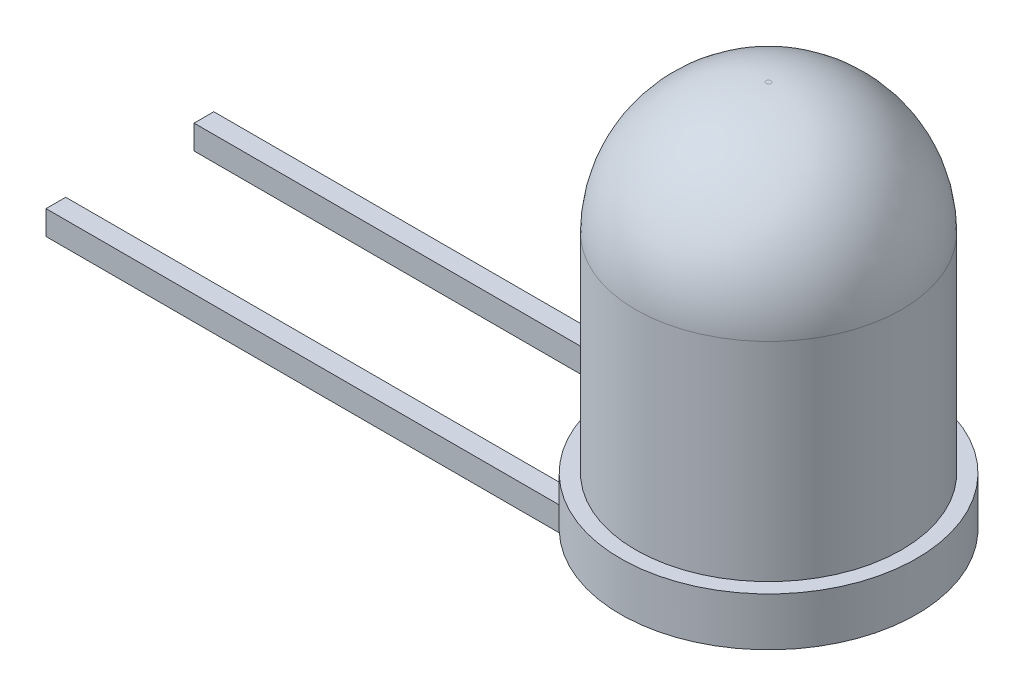
ISO-10303-21;
HEADER;
FILE_DESCRIPTION(('STEP AP214'),'2;1');
FILE_NAME('part.step','',(''),(''),'','','');
FILE_SCHEMA(('AUTOMOTIVE_DESIGN { 1 0 10303 214 1 1 1 1 }'));
ENDSEC;
DATA;
#1=APPLICATION_CONTEXT('core data for automotive mechanical design processes');
#2=APPLICATION_PROTOCOL_DEFINITION('international standard','automotive_design',2000,#1);
#3=PRODUCT_CONTEXT('',#1,'mechanical');
#4=PRODUCT('Part','Part','',(#3));
#5=PRODUCT_RELATED_PRODUCT_CATEGORY('part','',(#4));
#6=PRODUCT_DEFINITION_FORMATION('','',#4);
#7=PRODUCT_DEFINITION_CONTEXT('part definition',#1,'design');
#8=PRODUCT_DEFINITION('design','',#6,#7);
#9=PRODUCT_DEFINITION_SHAPE('','',#8);
#10=(LENGTH_UNIT() NAMED_UNIT(*) SI_UNIT(.MILLI.,.METRE.));
#11=(NAMED_UNIT(*) PLANE_ANGLE_UNIT() SI_UNIT($,.RADIAN.));
#12=(NAMED_UNIT(*) SI_UNIT($,.STERADIAN.) SOLID_ANGLE_UNIT());
#13=UNCERTAINTY_MEASURE_WITH_UNIT(LENGTH_MEASURE(1.E-05),#10,'distance_accuracy_value','');
#14=(GEOMETRIC_REPRESENTATION_CONTEXT(3) GLOBAL_UNCERTAINTY_ASSIGNED_CONTEXT((#13)) GLOBAL_UNIT_ASSIGNED_CONTEXT((#10,
#11,#12)) REPRESENTATION_CONTEXT('',''));
#15=CARTESIAN_POINT('',(0.,0.,0.));
#16=DIRECTION('',(0.,0.,1.));
#17=DIRECTION('',(1.,0.,0.));
#18=AXIS2_PLACEMENT_3D('',#15,#16,#17);
#19=CARTESIAN_POINT('',(0.,7.,0.));
#20=DIRECTION('',(0.,-1.,0.));
#21=DIRECTION('',(0.,0.,-1.));
#22=AXIS2_PLACEMENT_3D('',#19,#20,#21);
#23=CYLINDRICAL_SURFACE('',#22,2.75);
#24=CARTESIAN_POINT('',(0.,4.3,0.));
#25=DIRECTION('',(0.,1.,0.));
#26=DIRECTION('',(0.,0.,1.));
#27=AXIS2_PLACEMENT_3D('',#24,#25,#26);
#28=CIRCLE('',#27,2.75);
#29=CARTESIAN_POINT('',(0.,4.3,2.75));
#30=VERTEX_POINT('',#29);
#31=EDGE_CURVE('E190',#30,#30,#28,.F.);
#32=ORIENTED_EDGE('',*,*,#31,.T.);
#33=EDGE_LOOP('',(#32));
#34=FACE_BOUND('',#33,.T.);
#35=CARTESIAN_POINT('',(0.,0.,0.));
#36=DIRECTION('',(0.,-1.,0.));
#37=DIRECTION('',(0.,0.,-1.));
#38=AXIS2_PLACEMENT_3D('',#35,#36,#37);
#39=CIRCLE('',#38,2.75);
#40=CARTESIAN_POINT('',(0.,0.,-2.75));
#41=VERTEX_POINT('',#40);
#42=EDGE_CURVE('E180',#41,#41,#39,.T.);
#43=ORIENTED_EDGE('',*,*,#42,.F.);
#44=EDGE_LOOP('',(#43));
#45=FACE_BOUND('',#44,.T.);
#46=ADVANCED_FACE('F37',(#34,#45),#23,.T.);
#47=CARTESIAN_POINT('',(0.,7.,0.));
#48=DIRECTION('',(0.,1.,0.));
#49=DIRECTION('',(0.,0.,1.));
#50=AXIS2_PLACEMENT_3D('',#47,#48,#49);
#51=PLANE('',#50);
#52=CARTESIAN_POINT('',(0.,7.,0.));
#53=DIRECTION('',(0.,1.,0.));
#54=DIRECTION('',(0.,0.,1.));
#55=AXIS2_PLACEMENT_3D('',#52,#53,#54);
#56=CIRCLE('',#55,0.0500000000000001);
#57=CARTESIAN_POINT('',(0.,7.,0.0500000000000001));
#58=VERTEX_POINT('',#57);
#59=EDGE_CURVE('E187',#58,#58,#56,.T.);
#60=ORIENTED_EDGE('',*,*,#59,.T.);
#61=EDGE_LOOP('',(#60));
#62=FACE_BOUND('',#61,.T.);
#63=ADVANCED_FACE('F236',(#62),#51,.T.);
#64=CARTESIAN_POINT('',(0.,4.3,0.));
#65=DIRECTION('',(0.,1.,0.));
#66=DIRECTION('',(0.,0.,1.));
#67=AXIS2_PLACEMENT_3D('',#64,#65,#66);
#68=DEGENERATE_TOROIDAL_SURFACE('',#67,0.0500000000000001,2.7,.T.);
#69=ORIENTED_EDGE('',*,*,#31,.F.);
#70=EDGE_LOOP('',(#69));
#71=FACE_BOUND('',#70,.T.);
#72=ORIENTED_EDGE('',*,*,#59,.F.);
#73=EDGE_LOOP('',(#72));
#74=FACE_BOUND('',#73,.T.);
#75=ADVANCED_FACE('F242',(#71,#74),#68,.T.);
#76=CARTESIAN_POINT('',(0.,0.,0.));
#77=DIRECTION('',(0.,-1.,0.));
#78=DIRECTION('',(0.,0.,-1.));
#79=AXIS2_PLACEMENT_3D('',#76,#77,#78);
#80=PLANE('',#79);
#81=CARTESIAN_POINT('',(0.,0.,0.));
#82=DIRECTION('',(0.,-1.,0.));
#83=DIRECTION('',(0.,0.,-1.));
#84=AXIS2_PLACEMENT_3D('',#81,#82,#83);
#85=CIRCLE('',#84,3.06128010774859);
#86=CARTESIAN_POINT('',(0.,0.,-3.06128010774859));
#87=VERTEX_POINT('',#86);
#88=EDGE_CURVE('E176',#87,#87,#85,.T.);
#89=ORIENTED_EDGE('',*,*,#88,.F.);
#90=EDGE_LOOP('',(#89));
#91=FACE_BOUND('',#90,.T.);
#92=ORIENTED_EDGE('',*,*,#42,.T.);
#93=EDGE_LOOP('',(#92));
#94=FACE_BOUND('',#93,.T.);
#95=ADVANCED_FACE('F249',(#91,#94),#80,.F.);
#96=CARTESIAN_POINT('',(0.,-1.,0.));
#97=DIRECTION('',(0.,1.,0.));
#98=DIRECTION('',(0.,0.,1.));
#99=AXIS2_PLACEMENT_3D('',#96,#97,#98);
#100=CYLINDRICAL_SURFACE('',#99,3.06128010774859);
#101=CARTESIAN_POINT('',(0.,-1.,0.));
#102=DIRECTION('',(0.,-1.,0.));
#103=DIRECTION('',(0.,0.,-1.));
#104=AXIS2_PLACEMENT_3D('',#101,#102,#103);
#105=CIRCLE('',#104,3.06128010774859);
#106=CARTESIAN_POINT('',(-2.52263573457192,-1.,1.73428511172702));
#107=VERTEX_POINT('',#106);
#108=CARTESIAN_POINT('',(-2.75871712551884,-1.,1.32699499602157));
#109=VERTEX_POINT('',#108);
#110=EDGE_CURVE('E177',#107,#109,#105,.T.);
#111=ORIENTED_EDGE('',*,*,#110,.F.);
#112=CARTESIAN_POINT('',(-2.52263573457192,-1.,-1.73428511172702));
#113=VERTEX_POINT('',#112);
#114=EDGE_CURVE('E182',#113,#107,#105,.T.);
#115=ORIENTED_EDGE('',*,*,#114,.F.);
#116=CARTESIAN_POINT('',(-2.75871712551884,-1.,-1.32699499602157));
#117=VERTEX_POINT('',#116);
#118=EDGE_CURVE('E268',#117,#113,#105,.T.);
#119=ORIENTED_EDGE('',*,*,#118,.F.);
#120=EDGE_CURVE('E181',#109,#117,#105,.T.);
#121=ORIENTED_EDGE('',*,*,#120,.F.);
#122=EDGE_LOOP('',(#111,#115,#119,#121));
#123=FACE_BOUND('',#122,.T.);
#124=ORIENTED_EDGE('',*,*,#88,.T.);
#125=EDGE_LOOP('',(#124));
#126=FACE_BOUND('',#125,.T.);
#127=ADVANCED_FACE('F270',(#123,#126),#100,.T.);
#128=CARTESIAN_POINT('',(0.,-1.,0.));
#129=DIRECTION('',(0.,-1.,0.));
#130=DIRECTION('',(0.,0.,-1.));
#131=AXIS2_PLACEMENT_3D('',#128,#129,#130);
#132=PLANE('',#131);
#133=DIRECTION('',(-1.,0.,0.));
#134=VECTOR('',#133,1.);
#135=CARTESIAN_POINT('',(0.,-1.,-1.32699499602157));
#136=LINE('',#135,#134);
#137=CARTESIAN_POINT('',(0.,-1.,-1.32699499602157));
#138=VERTEX_POINT('',#137);
#139=EDGE_CURVE('E196',#138,#117,#136,.T.);
#140=ORIENTED_EDGE('',*,*,#139,.F.);
#141=DIRECTION('',(0.,0.,1.));
#142=VECTOR('',#141,1.);
#143=CARTESIAN_POINT('',(0.,-1.,0.));
#144=LINE('',#143,#142);
#145=CARTESIAN_POINT('',(0.,-1.,-1.73428511172702));
#146=VERTEX_POINT('',#145);
#147=EDGE_CURVE('E139',#146,#138,#144,.T.);
#148=ORIENTED_EDGE('',*,*,#147,.F.);
#149=DIRECTION('',(-1.,0.,0.));
#150=VECTOR('',#149,1.);
#151=CARTESIAN_POINT('',(0.,-1.,-1.73428511172702));
#152=LINE('',#151,#150);
#153=EDGE_CURVE('E193',#146,#113,#152,.T.);
#154=ORIENTED_EDGE('',*,*,#153,.T.);
#155=ORIENTED_EDGE('',*,*,#114,.T.);
#156=DIRECTION('',(1.,0.,0.));
#157=VECTOR('',#156,1.);
#158=CARTESIAN_POINT('',(0.,-1.,1.73428511172702));
#159=LINE('',#158,#157);
#160=CARTESIAN_POINT('',(0.,-1.,1.73428511172702));
#161=VERTEX_POINT('',#160);
#162=EDGE_CURVE('E170',#107,#161,#159,.T.);
#163=ORIENTED_EDGE('',*,*,#162,.T.);
#164=DIRECTION('',(0.,0.,1.));
#165=VECTOR('',#164,1.);
#166=CARTESIAN_POINT('',(0.,-1.,0.));
#167=LINE('',#166,#165);
#168=CARTESIAN_POINT('',(0.,-1.,1.32699499602157));
#169=VERTEX_POINT('',#168);
#170=EDGE_CURVE('E164',#169,#161,#167,.T.);
#171=ORIENTED_EDGE('',*,*,#170,.F.);
#172=DIRECTION('',(1.,0.,0.));
#173=VECTOR('',#172,1.);
#174=CARTESIAN_POINT('',(0.,-1.,1.32699499602157));
#175=LINE('',#174,#173);
#176=EDGE_CURVE('E165',#109,#169,#175,.T.);
#177=ORIENTED_EDGE('',*,*,#176,.F.);
#178=ORIENTED_EDGE('',*,*,#120,.T.);
#179=EDGE_LOOP('',(#140,#148,#154,#155,#163,#171,#177,#178));
#180=FACE_BOUND('',#179,.T.);
#181=ADVANCED_FACE('F212',(#180),#132,.T.);
#182=CARTESIAN_POINT('',(0.,-1.,0.));
#183=DIRECTION('',(0.,-1.,0.));
#184=DIRECTION('',(0.,0.,-1.));
#185=AXIS2_PLACEMENT_3D('',#182,#183,#184);
#186=PLANE('',#185);
#187=CARTESIAN_POINT('',(-13.2030457028804,-1.,1.73428511172702));
#188=VERTEX_POINT('',#187);
#189=EDGE_CURVE('E167',#188,#107,#159,.T.);
#190=ORIENTED_EDGE('',*,*,#189,.T.);
#191=ORIENTED_EDGE('',*,*,#110,.T.);
#192=CARTESIAN_POINT('',(-13.2030457028804,-1.,1.32699499602157));
#193=VERTEX_POINT('',#192);
#194=EDGE_CURVE('E123',#193,#109,#175,.T.);
#195=ORIENTED_EDGE('',*,*,#194,.F.);
#196=DIRECTION('',(0.,0.,1.));
#197=VECTOR('',#196,1.);
#198=CARTESIAN_POINT('',(-13.2030457028804,-1.,0.));
#199=LINE('',#198,#197);
#200=EDGE_CURVE('E155',#193,#188,#199,.T.);
#201=ORIENTED_EDGE('',*,*,#200,.T.);
#202=EDGE_LOOP('',(#190,#191,#195,#201));
#203=FACE_BOUND('',#202,.T.);
#204=ADVANCED_FACE('F223',(#203),#186,.F.);
#205=CARTESIAN_POINT('',(0.,-1.5,1.32699499602157));
#206=DIRECTION('',(0.,0.,1.));
#207=DIRECTION('',(1.,0.,0.));
#208=AXIS2_PLACEMENT_3D('',#205,#206,#207);
#209=PLANE('',#208);
#210=ORIENTED_EDGE('',*,*,#176,.T.);
#211=CARTESIAN_POINT('',(-0.670820393249937,-0.8,1.32699499602157));
#212=DIRECTION('',(0.,0.,1.));
#213=DIRECTION('',(1.,0.,0.));
#214=AXIS2_PLACEMENT_3D('',#211,#212,#213);
#215=CIRCLE('',#214,0.7);
#216=CARTESIAN_POINT('',(-0.670820393249937,-1.5,1.32699499602157));
#217=VERTEX_POINT('',#216);
#218=EDGE_CURVE('E11',#169,#217,#215,.F.);
#219=ORIENTED_EDGE('',*,*,#218,.T.);
#220=DIRECTION('',(1.,0.,0.));
#221=VECTOR('',#220,1.);
#222=CARTESIAN_POINT('',(0.,-1.5,1.32699499602157));
#223=LINE('',#222,#221);
#224=CARTESIAN_POINT('',(-13.2030457028804,-1.5,1.32699499602157));
#225=VERTEX_POINT('',#224);
#226=EDGE_CURVE('E152',#225,#217,#223,.T.);
#227=ORIENTED_EDGE('',*,*,#226,.F.);
#228=DIRECTION('',(0.,1.,0.));
#229=VECTOR('',#228,1.);
#230=CARTESIAN_POINT('',(-13.2030457028804,-1.5,1.32699499602157));
#231=LINE('',#230,#229);
#232=EDGE_CURVE('E161',#225,#193,#231,.T.);
#233=ORIENTED_EDGE('',*,*,#232,.T.);
#234=ORIENTED_EDGE('',*,*,#194,.T.);
#235=EDGE_LOOP('',(#210,#219,#227,#233,#234));
#236=FACE_BOUND('',#235,.T.);
#237=ADVANCED_FACE('F218',(#236),#209,.F.);
#238=CARTESIAN_POINT('',(0.,-1.5,1.73428511172702));
#239=DIRECTION('',(0.,0.,1.));
#240=DIRECTION('',(1.,0.,0.));
#241=AXIS2_PLACEMENT_3D('',#238,#239,#240);
#242=PLANE('',#241);
#243=DIRECTION('',(1.,0.,0.));
#244=VECTOR('',#243,1.);
#245=CARTESIAN_POINT('',(0.,-1.5,1.73428511172702));
#246=LINE('',#245,#244);
#247=CARTESIAN_POINT('',(-13.2030457028804,-1.5,1.73428511172702));
#248=VERTEX_POINT('',#247);
#249=CARTESIAN_POINT('',(-0.670820393249937,-1.5,1.73428511172702));
#250=VERTEX_POINT('',#249);
#251=EDGE_CURVE('E154',#248,#250,#246,.T.);
#252=ORIENTED_EDGE('',*,*,#251,.T.);
#253=CARTESIAN_POINT('',(-0.670820393249937,-0.8,1.73428511172702));
#254=DIRECTION('',(0.,0.,1.));
#255=DIRECTION('',(1.,0.,0.));
#256=AXIS2_PLACEMENT_3D('',#253,#254,#255);
#257=CIRCLE('',#256,0.7);
#258=EDGE_CURVE('E45',#250,#161,#257,.T.);
#259=ORIENTED_EDGE('',*,*,#258,.T.);
#260=ORIENTED_EDGE('',*,*,#162,.F.);
#261=ORIENTED_EDGE('',*,*,#189,.F.);
#262=DIRECTION('',(0.,1.,0.));
#263=VECTOR('',#262,1.);
#264=CARTESIAN_POINT('',(-13.2030457028804,-1.5,1.73428511172702));
#265=LINE('',#264,#263);
#266=EDGE_CURVE('E174',#248,#188,#265,.T.);
#267=ORIENTED_EDGE('',*,*,#266,.F.);
#268=EDGE_LOOP('',(#252,#259,#260,#261,#267));
#269=FACE_BOUND('',#268,.T.);
#270=ADVANCED_FACE('F207',(#269),#242,.T.);
#271=CARTESIAN_POINT('',(-13.2030457028804,-1.5,0.));
#272=DIRECTION('',(-1.,0.,0.));
#273=DIRECTION('',(0.,0.,1.));
#274=AXIS2_PLACEMENT_3D('',#271,#272,#273);
#275=PLANE('',#274);
#276=ORIENTED_EDGE('',*,*,#200,.F.);
#277=ORIENTED_EDGE('',*,*,#232,.F.);
#278=DIRECTION('',(0.,0.,1.));
#279=VECTOR('',#278,1.);
#280=CARTESIAN_POINT('',(-13.2030457028804,-1.5,0.));
#281=LINE('',#280,#279);
#282=EDGE_CURVE('E158',#225,#248,#281,.T.);
#283=ORIENTED_EDGE('',*,*,#282,.T.);
#284=ORIENTED_EDGE('',*,*,#266,.T.);
#285=EDGE_LOOP('',(#276,#277,#283,#284));
#286=FACE_BOUND('',#285,.T.);
#287=ADVANCED_FACE('F224',(#286),#275,.T.);
#288=CARTESIAN_POINT('',(0.,-1.5,0.));
#289=DIRECTION('',(0.,-1.,0.));
#290=DIRECTION('',(0.,0.,-1.));
#291=AXIS2_PLACEMENT_3D('',#288,#289,#290);
#292=PLANE('',#291);
#293=ORIENTED_EDGE('',*,*,#226,.T.);
#294=DIRECTION('',(0.,0.,-1.));
#295=VECTOR('',#294,1.);
#296=CARTESIAN_POINT('',(-0.670820393249937,-1.5,1.73428511172702));
#297=LINE('',#296,#295);
#298=EDGE_CURVE('E203',#217,#250,#297,.F.);
#299=ORIENTED_EDGE('',*,*,#298,.T.);
#300=ORIENTED_EDGE('',*,*,#251,.F.);
#301=ORIENTED_EDGE('',*,*,#282,.F.);
#302=EDGE_LOOP('',(#293,#299,#300,#301));
#303=FACE_BOUND('',#302,.T.);
#304=ADVANCED_FACE('F216',(#303),#292,.T.);
#305=CARTESIAN_POINT('',(0.,-1.,0.));
#306=DIRECTION('',(0.,-1.,0.));
#307=DIRECTION('',(0.,0.,-1.));
#308=AXIS2_PLACEMENT_3D('',#305,#306,#307);
#309=PLANE('',#308);
#310=DIRECTION('',(1.,0.,0.));
#311=VECTOR('',#310,1.);
#312=CARTESIAN_POINT('',(0.,-1.,-1.32699499602157));
#313=LINE('',#312,#311);
#314=CARTESIAN_POINT('',(-13.2030457028804,-1.,-1.32699499602157));
#315=VERTEX_POINT('',#314);
#316=EDGE_CURVE('E120',#315,#117,#313,.T.);
#317=ORIENTED_EDGE('',*,*,#316,.T.);
#318=ORIENTED_EDGE('',*,*,#118,.T.);
#319=DIRECTION('',(1.,0.,0.));
#320=VECTOR('',#319,1.);
#321=CARTESIAN_POINT('',(0.,-1.,-1.73428511172702));
#322=LINE('',#321,#320);
#323=CARTESIAN_POINT('',(-13.2030457028804,-1.,-1.73428511172702));
#324=VERTEX_POINT('',#323);
#325=EDGE_CURVE('E142',#324,#113,#322,.T.);
#326=ORIENTED_EDGE('',*,*,#325,.F.);
#327=DIRECTION('',(0.,0.,-1.));
#328=VECTOR('',#327,1.);
#329=CARTESIAN_POINT('',(-13.2030457028804,-1.,0.));
#330=LINE('',#329,#328);
#331=EDGE_CURVE('E147',#315,#324,#330,.T.);
#332=ORIENTED_EDGE('',*,*,#331,.F.);
#333=EDGE_LOOP('',(#317,#318,#326,#332));
#334=FACE_BOUND('',#333,.T.);
#335=ADVANCED_FACE('F231',(#334),#309,.F.);
#336=CARTESIAN_POINT('',(0.,-1.5,-1.32699499602157));
#337=DIRECTION('',(0.,0.,1.));
#338=DIRECTION('',(1.,0.,0.));
#339=AXIS2_PLACEMENT_3D('',#336,#337,#338);
#340=PLANE('',#339);
#341=DIRECTION('',(1.,0.,0.));
#342=VECTOR('',#341,1.);
#343=CARTESIAN_POINT('',(0.,-1.5,-1.32699499602157));
#344=LINE('',#343,#342);
#345=CARTESIAN_POINT('',(-13.2030457028804,-1.5,-1.32699499602157));
#346=VERTEX_POINT('',#345);
#347=CARTESIAN_POINT('',(-0.670820393249937,-1.5,-1.32699499602157));
#348=VERTEX_POINT('',#347);
#349=EDGE_CURVE('E118',#346,#348,#344,.T.);
#350=ORIENTED_EDGE('',*,*,#349,.T.);
#351=CARTESIAN_POINT('',(-0.670820393249937,-0.8,-1.32699499602157));
#352=DIRECTION('',(0.,0.,1.));
#353=DIRECTION('',(1.,0.,0.));
#354=AXIS2_PLACEMENT_3D('',#351,#352,#353);
#355=CIRCLE('',#354,0.7);
#356=EDGE_CURVE('E199',#348,#138,#355,.T.);
#357=ORIENTED_EDGE('',*,*,#356,.T.);
#358=ORIENTED_EDGE('',*,*,#139,.T.);
#359=ORIENTED_EDGE('',*,*,#316,.F.);
#360=DIRECTION('',(0.,1.,0.));
#361=VECTOR('',#360,1.);
#362=CARTESIAN_POINT('',(-13.2030457028804,-1.5,-1.32699499602157));
#363=LINE('',#362,#361);
#364=EDGE_CURVE('E114',#346,#315,#363,.T.);
#365=ORIENTED_EDGE('',*,*,#364,.F.);
#366=EDGE_LOOP('',(#350,#357,#358,#359,#365));
#367=FACE_BOUND('',#366,.T.);
#368=ADVANCED_FACE('F116',(#367),#340,.T.);
#369=CARTESIAN_POINT('',(-13.2030457028804,-1.5,0.));
#370=DIRECTION('',(1.,0.,0.));
#371=DIRECTION('',(0.,0.,-1.));
#372=AXIS2_PLACEMENT_3D('',#369,#370,#371);
#373=PLANE('',#372);
#374=ORIENTED_EDGE('',*,*,#331,.T.);
#375=DIRECTION('',(0.,1.,0.));
#376=VECTOR('',#375,1.);
#377=CARTESIAN_POINT('',(-13.2030457028804,-1.5,-1.73428511172702));
#378=LINE('',#377,#376);
#379=CARTESIAN_POINT('',(-13.2030457028804,-1.5,-1.73428511172702));
#380=VERTEX_POINT('',#379);
#381=EDGE_CURVE('E124',#380,#324,#378,.T.);
#382=ORIENTED_EDGE('',*,*,#381,.F.);
#383=DIRECTION('',(0.,0.,-1.));
#384=VECTOR('',#383,1.);
#385=CARTESIAN_POINT('',(-13.2030457028804,-1.5,0.));
#386=LINE('',#385,#384);
#387=EDGE_CURVE('E127',#346,#380,#386,.T.);
#388=ORIENTED_EDGE('',*,*,#387,.F.);
#389=ORIENTED_EDGE('',*,*,#364,.T.);
#390=EDGE_LOOP('',(#374,#382,#388,#389));
#391=FACE_BOUND('',#390,.T.);
#392=ADVANCED_FACE('F128',(#391),#373,.F.);
#393=CARTESIAN_POINT('',(0.,-1.5,-1.73428511172702));
#394=DIRECTION('',(0.,0.,1.));
#395=DIRECTION('',(1.,0.,0.));
#396=AXIS2_PLACEMENT_3D('',#393,#394,#395);
#397=PLANE('',#396);
#398=ORIENTED_EDGE('',*,*,#153,.F.);
#399=CARTESIAN_POINT('',(-0.670820393249937,-0.8,-1.73428511172702));
#400=DIRECTION('',(0.,0.,1.));
#401=DIRECTION('',(1.,0.,0.));
#402=AXIS2_PLACEMENT_3D('',#399,#400,#401);
#403=CIRCLE('',#402,0.7);
#404=CARTESIAN_POINT('',(-0.670820393249937,-1.5,-1.73428511172702));
#405=VERTEX_POINT('',#404);
#406=EDGE_CURVE('E201',#146,#405,#403,.F.);
#407=ORIENTED_EDGE('',*,*,#406,.T.);
#408=DIRECTION('',(1.,0.,0.));
#409=VECTOR('',#408,1.);
#410=CARTESIAN_POINT('',(0.,-1.5,-1.73428511172702));
#411=LINE('',#410,#409);
#412=EDGE_CURVE('E133',#380,#405,#411,.T.);
#413=ORIENTED_EDGE('',*,*,#412,.F.);
#414=ORIENTED_EDGE('',*,*,#381,.T.);
#415=ORIENTED_EDGE('',*,*,#325,.T.);
#416=EDGE_LOOP('',(#398,#407,#413,#414,#415));
#417=FACE_BOUND('',#416,.T.);
#418=ADVANCED_FACE('F258',(#417),#397,.F.);
#419=CARTESIAN_POINT('',(0.,-1.5,0.));
#420=DIRECTION('',(0.,-1.,0.));
#421=DIRECTION('',(0.,0.,-1.));
#422=AXIS2_PLACEMENT_3D('',#419,#420,#421);
#423=PLANE('',#422);
#424=ORIENTED_EDGE('',*,*,#412,.T.);
#425=DIRECTION('',(0.,0.,-1.));
#426=VECTOR('',#425,1.);
#427=CARTESIAN_POINT('',(-0.670820393249937,-1.5,-1.32699499602157));
#428=LINE('',#427,#426);
#429=EDGE_CURVE('E138',#405,#348,#428,.F.);
#430=ORIENTED_EDGE('',*,*,#429,.T.);
#431=ORIENTED_EDGE('',*,*,#349,.F.);
#432=ORIENTED_EDGE('',*,*,#387,.T.);
#433=EDGE_LOOP('',(#424,#430,#431,#432));
#434=FACE_BOUND('',#433,.T.);
#435=ADVANCED_FACE('F136',(#434),#423,.T.);
#436=CARTESIAN_POINT('',(-0.670820393249937,-0.8,0.));
#437=DIRECTION('',(0.,0.,1.));
#438=DIRECTION('',(1.,0.,0.));
#439=AXIS2_PLACEMENT_3D('',#436,#437,#438);
#440=CYLINDRICAL_SURFACE('',#439,0.7);
#441=ORIENTED_EDGE('',*,*,#406,.F.);
#442=ORIENTED_EDGE('',*,*,#147,.T.);
#443=ORIENTED_EDGE('',*,*,#356,.F.);
#444=ORIENTED_EDGE('',*,*,#429,.F.);
#445=EDGE_LOOP('',(#441,#442,#443,#444));
#446=FACE_BOUND('',#445,.T.);
#447=ADVANCED_FACE('F251',(#446),#440,.T.);
#448=CARTESIAN_POINT('',(-0.670820393249937,-0.8,0.));
#449=DIRECTION('',(0.,0.,1.));
#450=DIRECTION('',(1.,0.,0.));
#451=AXIS2_PLACEMENT_3D('',#448,#449,#450);
#452=CYLINDRICAL_SURFACE('',#451,0.7);
#453=ORIENTED_EDGE('',*,*,#218,.F.);
#454=ORIENTED_EDGE('',*,*,#170,.T.);
#455=ORIENTED_EDGE('',*,*,#258,.F.);
#456=ORIENTED_EDGE('',*,*,#298,.F.);
#457=EDGE_LOOP('',(#453,#454,#455,#456));
#458=FACE_BOUND('',#457,.T.);
#459=ADVANCED_FACE('F39',(#458),#452,.T.);
#460=CLOSED_SHELL('',(#46,#63,#75,#95,#127,#181,#204,#237,#270,#287,#304,#335,#368,#392,#418,
#435,#447,#459));
#461=MANIFOLD_SOLID_BREP('B2',#460);
#462=ADVANCED_BREP_SHAPE_REPRESENTATION('',(#18,#461),#14);
#463=SHAPE_DEFINITION_REPRESENTATION(#9,#462);
ENDSEC;
END-ISO-10303-21;
